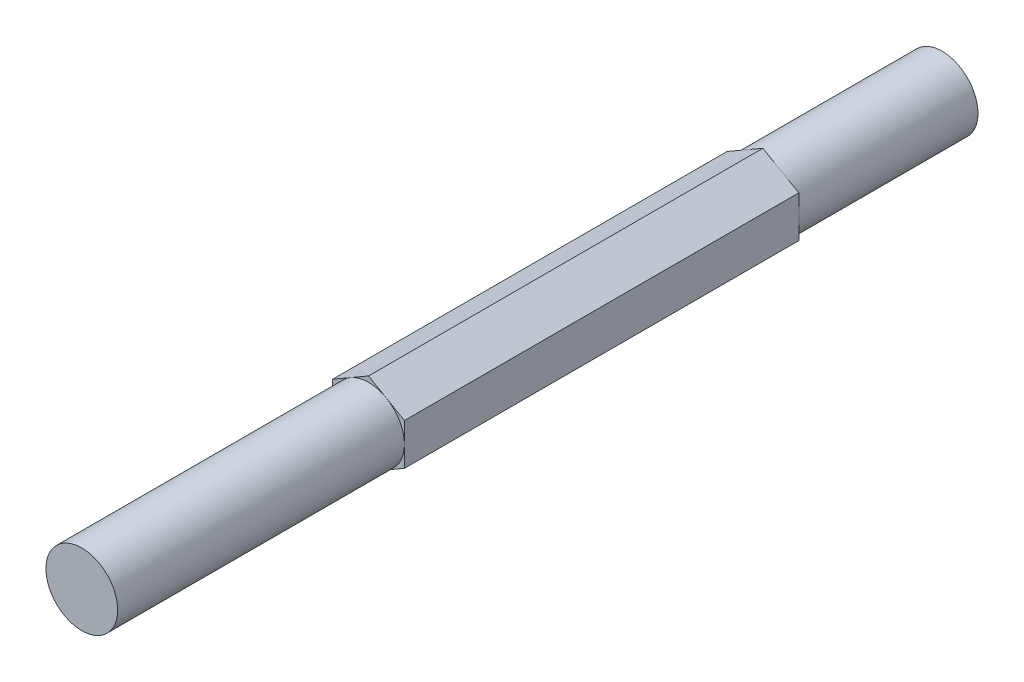
ISO-10303-21;
HEADER;
FILE_DESCRIPTION(('STEP AP214'),'2;1');
FILE_NAME('part.step','',(''),(''),'','','');
FILE_SCHEMA(('AUTOMOTIVE_DESIGN { 1 0 10303 214 1 1 1 1 }'));
ENDSEC;
DATA;
#1=APPLICATION_CONTEXT('core data for automotive mechanical design processes');
#2=APPLICATION_PROTOCOL_DEFINITION('international standard','automotive_design',2000,#1);
#3=PRODUCT_CONTEXT('',#1,'mechanical');
#4=PRODUCT('Part','Part','',(#3));
#5=PRODUCT_RELATED_PRODUCT_CATEGORY('part','',(#4));
#6=PRODUCT_DEFINITION_FORMATION('','',#4);
#7=PRODUCT_DEFINITION_CONTEXT('part definition',#1,'design');
#8=PRODUCT_DEFINITION('design','',#6,#7);
#9=PRODUCT_DEFINITION_SHAPE('','',#8);
#10=(LENGTH_UNIT() NAMED_UNIT(*) SI_UNIT(.MILLI.,.METRE.));
#11=(NAMED_UNIT(*) PLANE_ANGLE_UNIT() SI_UNIT($,.RADIAN.));
#12=(NAMED_UNIT(*) SI_UNIT($,.STERADIAN.) SOLID_ANGLE_UNIT());
#13=UNCERTAINTY_MEASURE_WITH_UNIT(LENGTH_MEASURE(1.E-05),#10,'distance_accuracy_value','');
#14=(GEOMETRIC_REPRESENTATION_CONTEXT(3) GLOBAL_UNCERTAINTY_ASSIGNED_CONTEXT((#13)) GLOBAL_UNIT_ASSIGNED_CONTEXT((#10,
#11,#12)) REPRESENTATION_CONTEXT('',''));
#15=CARTESIAN_POINT('',(0.,0.,0.));
#16=DIRECTION('',(0.,0.,1.));
#17=DIRECTION('',(1.,0.,0.));
#18=AXIS2_PLACEMENT_3D('',#15,#16,#17);
#19=CARTESIAN_POINT('',(3.17499999999998,1.83308710467707,76.2));
#20=DIRECTION('',(-0.5,-0.866025403784439,0.));
#21=DIRECTION('',(0.866025403784439,-0.5,0.));
#22=AXIS2_PLACEMENT_3D('',#19,#20,#21);
#23=PLANE('',#22);
#24=DIRECTION('',(0.866025403784439,-0.5,0.));
#25=VECTOR('',#24,1.);
#26=CARTESIAN_POINT('',(3.17499999999998,1.83308710467707,15.875));
#27=LINE('',#26,#25);
#28=CARTESIAN_POINT('',(0.,3.66617420935412,15.875));
#29=VERTEX_POINT('',#28);
#30=CARTESIAN_POINT('',(1.5875,2.74963065701559,15.875));
#31=VERTEX_POINT('',#30);
#32=EDGE_CURVE('E265',#29,#31,#27,.T.);
#33=ORIENTED_EDGE('',*,*,#32,.F.);
#34=DIRECTION('',(0.,0.,-1.));
#35=VECTOR('',#34,1.);
#36=CARTESIAN_POINT('',(0.,3.66617420935412,76.2));
#37=LINE('',#36,#35);
#38=CARTESIAN_POINT('',(0.,3.66617420935412,50.8));
#39=VERTEX_POINT('',#38);
#40=EDGE_CURVE('E192',#39,#29,#37,.T.);
#41=ORIENTED_EDGE('',*,*,#40,.F.);
#42=DIRECTION('',(-0.866025403784439,0.5,0.));
#43=VECTOR('',#42,1.);
#44=CARTESIAN_POINT('',(3.17499999999998,1.83308710467707,50.8));
#45=LINE('',#44,#43);
#46=CARTESIAN_POINT('',(1.58749999999999,2.74963065701558,50.8));
#47=VERTEX_POINT('',#46);
#48=EDGE_CURVE('E177',#47,#39,#45,.T.);
#49=ORIENTED_EDGE('',*,*,#48,.F.);
#50=CARTESIAN_POINT('',(3.17499999999998,1.83308710467707,50.8));
#51=VERTEX_POINT('',#50);
#52=EDGE_CURVE('E179',#51,#47,#45,.T.);
#53=ORIENTED_EDGE('',*,*,#52,.F.);
#54=DIRECTION('',(0.,0.,-1.));
#55=VECTOR('',#54,1.);
#56=CARTESIAN_POINT('',(3.17499999999998,1.83308710467707,76.2));
#57=LINE('',#56,#55);
#58=CARTESIAN_POINT('',(3.17499999999998,1.83308710467707,15.875));
#59=VERTEX_POINT('',#58);
#60=EDGE_CURVE('E180',#51,#59,#57,.T.);
#61=ORIENTED_EDGE('',*,*,#60,.T.);
#62=EDGE_CURVE('E264',#31,#59,#27,.T.);
#63=ORIENTED_EDGE('',*,*,#62,.F.);
#64=EDGE_LOOP('',(#33,#41,#49,#53,#61,#63));
#65=FACE_BOUND('',#64,.T.);
#66=ADVANCED_FACE('F34',(#65),#23,.F.);
#67=CARTESIAN_POINT('',(0.,3.66617420935412,76.2));
#68=DIRECTION('',(0.499999999999999,-0.866025403784439,0.));
#69=DIRECTION('',(0.866025403784439,0.499999999999999,0.));
#70=AXIS2_PLACEMENT_3D('',#67,#68,#69);
#71=PLANE('',#70);
#72=DIRECTION('',(0.866025403784439,0.499999999999999,0.));
#73=VECTOR('',#72,1.);
#74=CARTESIAN_POINT('',(0.,3.66617420935412,15.875));
#75=LINE('',#74,#73);
#76=CARTESIAN_POINT('',(-3.17500000000001,1.83308710467706,15.875));
#77=VERTEX_POINT('',#76);
#78=CARTESIAN_POINT('',(-1.5875,2.74963065701559,15.875));
#79=VERTEX_POINT('',#78);
#80=EDGE_CURVE('E149',#77,#79,#75,.T.);
#81=ORIENTED_EDGE('',*,*,#80,.F.);
#82=DIRECTION('',(0.,0.,-1.));
#83=VECTOR('',#82,1.);
#84=CARTESIAN_POINT('',(-3.17500000000001,1.83308710467706,76.2));
#85=LINE('',#84,#83);
#86=CARTESIAN_POINT('',(-3.17500000000001,1.83308710467706,50.8));
#87=VERTEX_POINT('',#86);
#88=EDGE_CURVE('E157',#87,#77,#85,.T.);
#89=ORIENTED_EDGE('',*,*,#88,.F.);
#90=DIRECTION('',(-0.866025403784439,-0.499999999999999,0.));
#91=VECTOR('',#90,1.);
#92=CARTESIAN_POINT('',(0.,3.66617420935412,50.8));
#93=LINE('',#92,#91);
#94=CARTESIAN_POINT('',(-1.58749999999999,2.74963065701558,50.8));
#95=VERTEX_POINT('',#94);
#96=EDGE_CURVE('E174',#95,#87,#93,.T.);
#97=ORIENTED_EDGE('',*,*,#96,.F.);
#98=EDGE_CURVE('E176',#39,#95,#93,.T.);
#99=ORIENTED_EDGE('',*,*,#98,.F.);
#100=ORIENTED_EDGE('',*,*,#40,.T.);
#101=EDGE_CURVE('E162',#79,#29,#75,.T.);
#102=ORIENTED_EDGE('',*,*,#101,.F.);
#103=EDGE_LOOP('',(#81,#89,#97,#99,#100,#102));
#104=FACE_BOUND('',#103,.T.);
#105=ADVANCED_FACE('F232',(#104),#71,.F.);
#106=CARTESIAN_POINT('',(-3.17500000000001,1.83308710467706,76.2));
#107=DIRECTION('',(1.,0.,0.));
#108=DIRECTION('',(0.,0.,-1.));
#109=AXIS2_PLACEMENT_3D('',#106,#107,#108);
#110=PLANE('',#109);
#111=DIRECTION('',(0.,1.,0.));
#112=VECTOR('',#111,1.);
#113=CARTESIAN_POINT('',(-3.17500000000001,1.83308710467706,15.875));
#114=LINE('',#113,#112);
#115=CARTESIAN_POINT('',(-3.17500000000001,-1.83308710467706,15.875));
#116=VERTEX_POINT('',#115);
#117=CARTESIAN_POINT('',(-3.175,0.,15.875));
#118=VERTEX_POINT('',#117);
#119=EDGE_CURVE('E124',#116,#118,#114,.T.);
#120=ORIENTED_EDGE('',*,*,#119,.F.);
#121=DIRECTION('',(0.,0.,-1.));
#122=VECTOR('',#121,1.);
#123=CARTESIAN_POINT('',(-3.17500000000001,-1.83308710467706,76.2));
#124=LINE('',#123,#122);
#125=CARTESIAN_POINT('',(-3.17500000000001,-1.83308710467706,50.8));
#126=VERTEX_POINT('',#125);
#127=EDGE_CURVE('E189',#126,#116,#124,.T.);
#128=ORIENTED_EDGE('',*,*,#127,.F.);
#129=DIRECTION('',(0.,-1.,0.));
#130=VECTOR('',#129,1.);
#131=CARTESIAN_POINT('',(-3.17500000000001,1.83308710467706,50.8));
#132=LINE('',#131,#130);
#133=CARTESIAN_POINT('',(-3.17499999999998,0.,50.8));
#134=VERTEX_POINT('',#133);
#135=EDGE_CURVE('E171',#134,#126,#132,.T.);
#136=ORIENTED_EDGE('',*,*,#135,.F.);
#137=EDGE_CURVE('E173',#87,#134,#132,.T.);
#138=ORIENTED_EDGE('',*,*,#137,.F.);
#139=ORIENTED_EDGE('',*,*,#88,.T.);
#140=EDGE_CURVE('E136',#118,#77,#114,.T.);
#141=ORIENTED_EDGE('',*,*,#140,.F.);
#142=EDGE_LOOP('',(#120,#128,#136,#138,#139,#141));
#143=FACE_BOUND('',#142,.T.);
#144=ADVANCED_FACE('F154',(#143),#110,.F.);
#145=CARTESIAN_POINT('',(-3.17500000000001,-1.83308710467706,76.2));
#146=DIRECTION('',(0.500000000000001,0.866025403784438,0.));
#147=DIRECTION('',(-0.866025403784438,0.500000000000001,0.));
#148=AXIS2_PLACEMENT_3D('',#145,#146,#147);
#149=PLANE('',#148);
#150=DIRECTION('',(-0.866025403784438,0.500000000000001,0.));
#151=VECTOR('',#150,1.);
#152=CARTESIAN_POINT('',(-3.17500000000001,-1.83308710467706,15.875));
#153=LINE('',#152,#151);
#154=CARTESIAN_POINT('',(0.,-3.66617420935412,15.875));
#155=VERTEX_POINT('',#154);
#156=CARTESIAN_POINT('',(-1.5875,-2.74963065701559,15.875));
#157=VERTEX_POINT('',#156);
#158=EDGE_CURVE('E159',#155,#157,#153,.T.);
#159=ORIENTED_EDGE('',*,*,#158,.F.);
#160=DIRECTION('',(0.,0.,-1.));
#161=VECTOR('',#160,1.);
#162=CARTESIAN_POINT('',(0.,-3.66617420935412,76.2));
#163=LINE('',#162,#161);
#164=CARTESIAN_POINT('',(0.,-3.66617420935412,50.8));
#165=VERTEX_POINT('',#164);
#166=EDGE_CURVE('E186',#165,#155,#163,.T.);
#167=ORIENTED_EDGE('',*,*,#166,.F.);
#168=DIRECTION('',(0.866025403784438,-0.500000000000001,0.));
#169=VECTOR('',#168,1.);
#170=CARTESIAN_POINT('',(-3.17500000000001,-1.83308710467706,50.8));
#171=LINE('',#170,#169);
#172=CARTESIAN_POINT('',(-1.58749999999999,-2.74963065701558,50.8));
#173=VERTEX_POINT('',#172);
#174=EDGE_CURVE('E168',#173,#165,#171,.T.);
#175=ORIENTED_EDGE('',*,*,#174,.F.);
#176=EDGE_CURVE('E170',#126,#173,#171,.T.);
#177=ORIENTED_EDGE('',*,*,#176,.F.);
#178=ORIENTED_EDGE('',*,*,#127,.T.);
#179=EDGE_CURVE('E130',#157,#116,#153,.T.);
#180=ORIENTED_EDGE('',*,*,#179,.F.);
#181=EDGE_LOOP('',(#159,#167,#175,#177,#178,#180));
#182=FACE_BOUND('',#181,.T.);
#183=ADVANCED_FACE('F248',(#182),#149,.F.);
#184=CARTESIAN_POINT('',(0.,-3.66617420935412,76.2));
#185=DIRECTION('',(-0.5,0.866025403784439,0.));
#186=DIRECTION('',(-0.866025403784439,-0.5,0.));
#187=AXIS2_PLACEMENT_3D('',#184,#185,#186);
#188=PLANE('',#187);
#189=DIRECTION('',(-0.866025403784439,-0.5,0.));
#190=VECTOR('',#189,1.);
#191=CARTESIAN_POINT('',(0.,-3.66617420935412,15.875));
#192=LINE('',#191,#190);
#193=CARTESIAN_POINT('',(3.17499999999998,-1.83308710467706,15.875));
#194=VERTEX_POINT('',#193);
#195=CARTESIAN_POINT('',(1.5875,-2.74963065701559,15.875));
#196=VERTEX_POINT('',#195);
#197=EDGE_CURVE('E151',#194,#196,#192,.T.);
#198=ORIENTED_EDGE('',*,*,#197,.F.);
#199=DIRECTION('',(0.,0.,-1.));
#200=VECTOR('',#199,1.);
#201=CARTESIAN_POINT('',(3.17499999999998,-1.83308710467706,76.2));
#202=LINE('',#201,#200);
#203=CARTESIAN_POINT('',(3.17499999999998,-1.83308710467706,50.8));
#204=VERTEX_POINT('',#203);
#205=EDGE_CURVE('E183',#204,#194,#202,.T.);
#206=ORIENTED_EDGE('',*,*,#205,.F.);
#207=DIRECTION('',(0.866025403784439,0.5,0.));
#208=VECTOR('',#207,1.);
#209=CARTESIAN_POINT('',(0.,-3.66617420935412,50.8));
#210=LINE('',#209,#208);
#211=CARTESIAN_POINT('',(1.58749999999999,-2.74963065701558,50.8));
#212=VERTEX_POINT('',#211);
#213=EDGE_CURVE('E164',#212,#204,#210,.T.);
#214=ORIENTED_EDGE('',*,*,#213,.F.);
#215=EDGE_CURVE('E167',#165,#212,#210,.T.);
#216=ORIENTED_EDGE('',*,*,#215,.F.);
#217=ORIENTED_EDGE('',*,*,#166,.T.);
#218=EDGE_CURVE('E267',#196,#155,#192,.T.);
#219=ORIENTED_EDGE('',*,*,#218,.F.);
#220=EDGE_LOOP('',(#198,#206,#214,#216,#217,#219));
#221=FACE_BOUND('',#220,.T.);
#222=ADVANCED_FACE('F256',(#221),#188,.F.);
#223=CARTESIAN_POINT('',(3.17499999999998,-1.83308710467706,76.2));
#224=DIRECTION('',(-1.,0.,0.));
#225=DIRECTION('',(0.,0.,1.));
#226=AXIS2_PLACEMENT_3D('',#223,#224,#225);
#227=PLANE('',#226);
#228=DIRECTION('',(0.,-1.,0.));
#229=VECTOR('',#228,1.);
#230=CARTESIAN_POINT('',(3.17499999999998,-1.83308710467706,15.875));
#231=LINE('',#230,#229);
#232=CARTESIAN_POINT('',(3.17499999999999,0.,15.875));
#233=VERTEX_POINT('',#232);
#234=EDGE_CURVE('E12',#59,#233,#231,.T.);
#235=ORIENTED_EDGE('',*,*,#234,.F.);
#236=ORIENTED_EDGE('',*,*,#60,.F.);
#237=DIRECTION('',(0.,1.,0.));
#238=VECTOR('',#237,1.);
#239=CARTESIAN_POINT('',(3.17499999999998,-1.83308710467706,50.8));
#240=LINE('',#239,#238);
#241=CARTESIAN_POINT('',(3.17499999999998,0.,50.8));
#242=VERTEX_POINT('',#241);
#243=EDGE_CURVE('E198',#242,#51,#240,.T.);
#244=ORIENTED_EDGE('',*,*,#243,.F.);
#245=EDGE_CURVE('E199',#204,#242,#240,.T.);
#246=ORIENTED_EDGE('',*,*,#245,.F.);
#247=ORIENTED_EDGE('',*,*,#205,.T.);
#248=EDGE_CURVE('E37',#233,#194,#231,.T.);
#249=ORIENTED_EDGE('',*,*,#248,.F.);
#250=EDGE_LOOP('',(#235,#236,#244,#246,#247,#249));
#251=FACE_BOUND('',#250,.T.);
#252=ADVANCED_FACE('F216',(#251),#227,.F.);
#253=CARTESIAN_POINT('',(0.,0.,50.8));
#254=DIRECTION('',(0.,0.,1.));
#255=DIRECTION('',(1.,0.,0.));
#256=AXIS2_PLACEMENT_3D('',#253,#254,#255);
#257=PLANE('',#256);
#258=ORIENTED_EDGE('',*,*,#52,.T.);
#259=CARTESIAN_POINT('',(0.,0.,50.8));
#260=DIRECTION('',(0.,0.,1.));
#261=DIRECTION('',(1.,0.,0.));
#262=AXIS2_PLACEMENT_3D('',#259,#260,#261);
#263=CIRCLE('',#262,3.17499999999998);
#264=EDGE_CURVE('E56',#242,#47,#263,.T.);
#265=ORIENTED_EDGE('',*,*,#264,.F.);
#266=ORIENTED_EDGE('',*,*,#243,.T.);
#267=EDGE_LOOP('',(#258,#265,#266));
#268=FACE_BOUND('',#267,.T.);
#269=ADVANCED_FACE('F218',(#268),#257,.T.);
#270=ORIENTED_EDGE('',*,*,#48,.T.);
#271=ORIENTED_EDGE('',*,*,#98,.T.);
#272=EDGE_CURVE('E165',#47,#95,#263,.T.);
#273=ORIENTED_EDGE('',*,*,#272,.F.);
#274=EDGE_LOOP('',(#270,#271,#273));
#275=FACE_BOUND('',#274,.T.);
#276=ADVANCED_FACE('F227',(#275),#257,.T.);
#277=ORIENTED_EDGE('',*,*,#96,.T.);
#278=ORIENTED_EDGE('',*,*,#137,.T.);
#279=EDGE_CURVE('E237',#95,#134,#263,.T.);
#280=ORIENTED_EDGE('',*,*,#279,.F.);
#281=EDGE_LOOP('',(#277,#278,#280));
#282=FACE_BOUND('',#281,.T.);
#283=ADVANCED_FACE('F234',(#282),#257,.T.);
#284=ORIENTED_EDGE('',*,*,#135,.T.);
#285=ORIENTED_EDGE('',*,*,#176,.T.);
#286=EDGE_CURVE('E244',#134,#173,#263,.T.);
#287=ORIENTED_EDGE('',*,*,#286,.F.);
#288=EDGE_LOOP('',(#284,#285,#287));
#289=FACE_BOUND('',#288,.T.);
#290=ADVANCED_FACE('F241',(#289),#257,.T.);
#291=ORIENTED_EDGE('',*,*,#174,.T.);
#292=ORIENTED_EDGE('',*,*,#215,.T.);
#293=EDGE_CURVE('E253',#173,#212,#263,.T.);
#294=ORIENTED_EDGE('',*,*,#293,.F.);
#295=EDGE_LOOP('',(#291,#292,#294));
#296=FACE_BOUND('',#295,.T.);
#297=ADVANCED_FACE('F252',(#296),#257,.T.);
#298=ORIENTED_EDGE('',*,*,#213,.T.);
#299=ORIENTED_EDGE('',*,*,#245,.T.);
#300=EDGE_CURVE('E135',#212,#242,#263,.T.);
#301=ORIENTED_EDGE('',*,*,#300,.F.);
#302=EDGE_LOOP('',(#298,#299,#301));
#303=FACE_BOUND('',#302,.T.);
#304=ADVANCED_FACE('F209',(#303),#257,.T.);
#305=CARTESIAN_POINT('',(0.,0.,50.8));
#306=DIRECTION('',(0.,0.,1.));
#307=DIRECTION('',(1.,0.,0.));
#308=AXIS2_PLACEMENT_3D('',#305,#306,#307);
#309=CYLINDRICAL_SURFACE('',#308,3.17499999999998);
#310=CARTESIAN_POINT('',(0.,0.,76.2));
#311=DIRECTION('',(0.,0.,1.));
#312=DIRECTION('',(1.,0.,0.));
#313=AXIS2_PLACEMENT_3D('',#310,#311,#312);
#314=CIRCLE('',#313,3.17499999999998);
#315=CARTESIAN_POINT('',(3.17499999999998,0.,76.2));
#316=VERTEX_POINT('',#315);
#317=EDGE_CURVE('E195',#316,#316,#314,.T.);
#318=ORIENTED_EDGE('',*,*,#317,.F.);
#319=EDGE_LOOP('',(#318));
#320=FACE_BOUND('',#319,.T.);
#321=ORIENTED_EDGE('',*,*,#264,.T.);
#322=ORIENTED_EDGE('',*,*,#272,.T.);
#323=ORIENTED_EDGE('',*,*,#279,.T.);
#324=ORIENTED_EDGE('',*,*,#286,.T.);
#325=ORIENTED_EDGE('',*,*,#293,.T.);
#326=ORIENTED_EDGE('',*,*,#300,.T.);
#327=EDGE_LOOP('',(#321,#322,#323,#324,#325,#326));
#328=FACE_BOUND('',#327,.T.);
#329=ADVANCED_FACE('F303',(#320,#328),#309,.T.);
#330=CARTESIAN_POINT('',(0.,0.,76.2));
#331=DIRECTION('',(0.,0.,1.));
#332=DIRECTION('',(1.,0.,0.));
#333=AXIS2_PLACEMENT_3D('',#330,#331,#332);
#334=PLANE('',#333);
#335=ORIENTED_EDGE('',*,*,#317,.T.);
#336=EDGE_LOOP('',(#335));
#337=FACE_BOUND('',#336,.T.);
#338=ADVANCED_FACE('F300',(#337),#334,.T.);
#339=CARTESIAN_POINT('',(0.,0.,15.875));
#340=DIRECTION('',(0.,0.,-1.));
#341=DIRECTION('',(-1.,0.,0.));
#342=AXIS2_PLACEMENT_3D('',#339,#340,#341);
#343=PLANE('',#342);
#344=ORIENTED_EDGE('',*,*,#119,.T.);
#345=CARTESIAN_POINT('',(0.,0.,15.875));
#346=DIRECTION('',(0.,0.,-1.));
#347=DIRECTION('',(-1.,0.,0.));
#348=AXIS2_PLACEMENT_3D('',#345,#346,#347);
#349=CIRCLE('',#348,3.175);
#350=EDGE_CURVE('E127',#157,#118,#349,.T.);
#351=ORIENTED_EDGE('',*,*,#350,.F.);
#352=ORIENTED_EDGE('',*,*,#179,.T.);
#353=EDGE_LOOP('',(#344,#351,#352));
#354=FACE_BOUND('',#353,.T.);
#355=ADVANCED_FACE('F126',(#354),#343,.T.);
#356=ORIENTED_EDGE('',*,*,#140,.T.);
#357=ORIENTED_EDGE('',*,*,#80,.T.);
#358=EDGE_CURVE('E141',#118,#79,#349,.T.);
#359=ORIENTED_EDGE('',*,*,#358,.F.);
#360=EDGE_LOOP('',(#356,#357,#359));
#361=FACE_BOUND('',#360,.T.);
#362=ADVANCED_FACE('F147',(#361),#343,.T.);
#363=ORIENTED_EDGE('',*,*,#101,.T.);
#364=ORIENTED_EDGE('',*,*,#32,.T.);
#365=EDGE_CURVE('E152',#79,#31,#349,.T.);
#366=ORIENTED_EDGE('',*,*,#365,.F.);
#367=EDGE_LOOP('',(#363,#364,#366));
#368=FACE_BOUND('',#367,.T.);
#369=ADVANCED_FACE('F272',(#368),#343,.T.);
#370=ORIENTED_EDGE('',*,*,#158,.T.);
#371=EDGE_CURVE('E144',#196,#157,#349,.T.);
#372=ORIENTED_EDGE('',*,*,#371,.F.);
#373=ORIENTED_EDGE('',*,*,#218,.T.);
#374=EDGE_LOOP('',(#370,#372,#373));
#375=FACE_BOUND('',#374,.T.);
#376=ADVANCED_FACE('F270',(#375),#343,.T.);
#377=ORIENTED_EDGE('',*,*,#62,.T.);
#378=ORIENTED_EDGE('',*,*,#234,.T.);
#379=EDGE_CURVE('E48',#31,#233,#349,.T.);
#380=ORIENTED_EDGE('',*,*,#379,.F.);
#381=EDGE_LOOP('',(#377,#378,#380));
#382=FACE_BOUND('',#381,.T.);
#383=ADVANCED_FACE('F263',(#382),#343,.T.);
#384=ORIENTED_EDGE('',*,*,#197,.T.);
#385=EDGE_CURVE('E261',#233,#196,#349,.T.);
#386=ORIENTED_EDGE('',*,*,#385,.F.);
#387=ORIENTED_EDGE('',*,*,#248,.T.);
#388=EDGE_LOOP('',(#384,#386,#387));
#389=FACE_BOUND('',#388,.T.);
#390=ADVANCED_FACE('F260',(#389),#343,.T.);
#391=CARTESIAN_POINT('',(0.,0.,15.875));
#392=DIRECTION('',(0.,0.,-1.));
#393=DIRECTION('',(-1.,0.,0.));
#394=AXIS2_PLACEMENT_3D('',#391,#392,#393);
#395=CYLINDRICAL_SURFACE('',#394,3.175);
#396=CARTESIAN_POINT('',(0.,0.,0.));
#397=DIRECTION('',(0.,0.,1.));
#398=DIRECTION('',(1.,0.,0.));
#399=AXIS2_PLACEMENT_3D('',#396,#397,#398);
#400=CIRCLE('',#399,3.175);
#401=CARTESIAN_POINT('',(3.175,0.,0.));
#402=VERTEX_POINT('',#401);
#403=EDGE_CURVE('E200',#402,#402,#400,.T.);
#404=ORIENTED_EDGE('',*,*,#403,.T.);
#405=EDGE_LOOP('',(#404));
#406=FACE_BOUND('',#405,.T.);
#407=ORIENTED_EDGE('',*,*,#365,.T.);
#408=ORIENTED_EDGE('',*,*,#379,.T.);
#409=ORIENTED_EDGE('',*,*,#385,.T.);
#410=ORIENTED_EDGE('',*,*,#371,.T.);
#411=ORIENTED_EDGE('',*,*,#350,.T.);
#412=ORIENTED_EDGE('',*,*,#358,.T.);
#413=EDGE_LOOP('',(#407,#408,#409,#410,#411,#412));
#414=FACE_BOUND('',#413,.T.);
#415=ADVANCED_FACE('F140',(#406,#414),#395,.T.);
#416=CARTESIAN_POINT('',(0.,0.,0.));
#417=DIRECTION('',(0.,0.,1.));
#418=DIRECTION('',(1.,0.,0.));
#419=AXIS2_PLACEMENT_3D('',#416,#417,#418);
#420=PLANE('',#419);
#421=ORIENTED_EDGE('',*,*,#403,.F.);
#422=EDGE_LOOP('',(#421));
#423=FACE_BOUND('',#422,.T.);
#424=ADVANCED_FACE('F296',(#423),#420,.F.);
#425=CLOSED_SHELL('',(#66,#105,#144,#183,#222,#252,#269,#276,#283,#290,#297,#304,#329,#338,#355,
#362,#369,#376,#383,#390,#415,#424));
#426=MANIFOLD_SOLID_BREP('B2',#425);
#427=ADVANCED_BREP_SHAPE_REPRESENTATION('',(#18,#426),#14);
#428=SHAPE_DEFINITION_REPRESENTATION(#9,#427);
ENDSEC;
END-ISO-10303-21;
